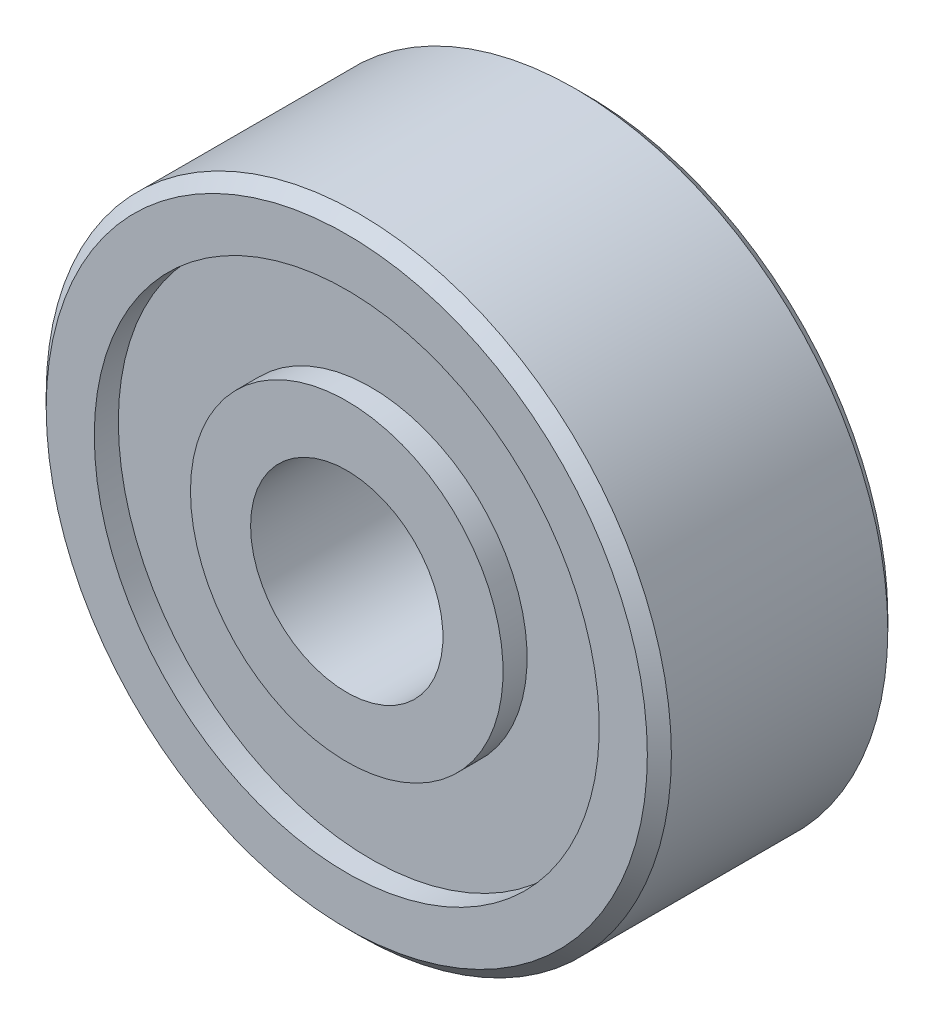
ISO-10303-21;
HEADER;
FILE_DESCRIPTION(('STEP AP214'),'2;1');
FILE_NAME('part.step','',(''),(''),'','','');
FILE_SCHEMA(('AUTOMOTIVE_DESIGN { 1 0 10303 214 1 1 1 1 }'));
ENDSEC;
DATA;
#1=APPLICATION_CONTEXT('core data for automotive mechanical design processes');
#2=APPLICATION_PROTOCOL_DEFINITION('international standard','automotive_design',2000,#1);
#3=PRODUCT_CONTEXT('',#1,'mechanical');
#4=PRODUCT('Part','Part','',(#3));
#5=PRODUCT_RELATED_PRODUCT_CATEGORY('part','',(#4));
#6=PRODUCT_DEFINITION_FORMATION('','',#4);
#7=PRODUCT_DEFINITION_CONTEXT('part definition',#1,'design');
#8=PRODUCT_DEFINITION('design','',#6,#7);
#9=PRODUCT_DEFINITION_SHAPE('','',#8);
#10=(LENGTH_UNIT() NAMED_UNIT(*) SI_UNIT(.MILLI.,.METRE.));
#11=(NAMED_UNIT(*) PLANE_ANGLE_UNIT() SI_UNIT($,.RADIAN.));
#12=(NAMED_UNIT(*) SI_UNIT($,.STERADIAN.) SOLID_ANGLE_UNIT());
#13=UNCERTAINTY_MEASURE_WITH_UNIT(LENGTH_MEASURE(1.E-05),#10,'distance_accuracy_value','');
#14=(GEOMETRIC_REPRESENTATION_CONTEXT(3) GLOBAL_UNCERTAINTY_ASSIGNED_CONTEXT((#13)) GLOBAL_UNIT_ASSIGNED_CONTEXT((#10,
#11,#12)) REPRESENTATION_CONTEXT('',''));
#15=CARTESIAN_POINT('',(0.,0.,0.));
#16=DIRECTION('',(0.,0.,1.));
#17=DIRECTION('',(1.,0.,0.));
#18=AXIS2_PLACEMENT_3D('',#15,#16,#17);
#19=CARTESIAN_POINT('',(0.,0.,2.5));
#20=DIRECTION('',(0.,0.,-1.));
#21=DIRECTION('',(-1.,0.,0.));
#22=AXIS2_PLACEMENT_3D('',#19,#20,#21);
#23=CYLINDRICAL_SURFACE('',#22,6.5);
#24=CARTESIAN_POINT('',(0.,0.,2.25));
#25=DIRECTION('',(0.,0.,-1.));
#26=DIRECTION('',(-1.,0.,0.));
#27=AXIS2_PLACEMENT_3D('',#24,#25,#26);
#28=CIRCLE('',#27,6.5);
#29=CARTESIAN_POINT('',(-6.5,0.,2.25));
#30=VERTEX_POINT('',#29);
#31=EDGE_CURVE('E10',#30,#30,#28,.T.);
#32=ORIENTED_EDGE('',*,*,#31,.T.);
#33=EDGE_LOOP('',(#32));
#34=FACE_BOUND('',#33,.T.);
#35=CARTESIAN_POINT('',(0.,0.,-2.25));
#36=DIRECTION('',(0.,0.,-1.));
#37=DIRECTION('',(-1.,0.,0.));
#38=AXIS2_PLACEMENT_3D('',#35,#36,#37);
#39=CIRCLE('',#38,6.5);
#40=CARTESIAN_POINT('',(-6.49999999999999,0.,-2.25));
#41=VERTEX_POINT('',#40);
#42=EDGE_CURVE('E74',#41,#41,#39,.T.);
#43=ORIENTED_EDGE('',*,*,#42,.F.);
#44=EDGE_LOOP('',(#43));
#45=FACE_BOUND('',#44,.T.);
#46=ADVANCED_FACE('F28',(#34,#45),#23,.T.);
#47=CARTESIAN_POINT('',(0.,0.,2.25));
#48=DIRECTION('',(0.,0.,-1.));
#49=DIRECTION('',(-1.,0.,0.));
#50=AXIS2_PLACEMENT_3D('',#47,#48,#49);
#51=CONICAL_SURFACE('',#50,6.5,0.785398163397456);
#52=CARTESIAN_POINT('',(0.,0.,2.5));
#53=DIRECTION('',(0.,0.,-1.));
#54=DIRECTION('',(-1.,0.,0.));
#55=AXIS2_PLACEMENT_3D('',#52,#53,#54);
#56=CIRCLE('',#55,6.25);
#57=CARTESIAN_POINT('',(-6.24999999999999,0.,2.5));
#58=VERTEX_POINT('',#57);
#59=EDGE_CURVE('E34',#58,#58,#56,.T.);
#60=ORIENTED_EDGE('',*,*,#59,.T.);
#61=EDGE_LOOP('',(#60));
#62=FACE_BOUND('',#61,.T.);
#63=ORIENTED_EDGE('',*,*,#31,.F.);
#64=EDGE_LOOP('',(#63));
#65=FACE_BOUND('',#64,.T.);
#66=ADVANCED_FACE('F82',(#62,#65),#51,.T.);
#67=CARTESIAN_POINT('',(6.25,0.,2.5));
#68=DIRECTION('',(0.,0.,1.));
#69=DIRECTION('',(1.,0.,0.));
#70=AXIS2_PLACEMENT_3D('',#67,#68,#69);
#71=PLANE('',#70);
#72=CARTESIAN_POINT('',(0.,0.,2.5));
#73=DIRECTION('',(0.,0.,-1.));
#74=DIRECTION('',(-1.,0.,0.));
#75=AXIS2_PLACEMENT_3D('',#72,#73,#74);
#76=CIRCLE('',#75,5.25);
#77=CARTESIAN_POINT('',(-5.24999999999999,0.,2.5));
#78=VERTEX_POINT('',#77);
#79=EDGE_CURVE('E38',#78,#78,#76,.T.);
#80=ORIENTED_EDGE('',*,*,#79,.T.);
#81=EDGE_LOOP('',(#80));
#82=FACE_BOUND('',#81,.T.);
#83=ORIENTED_EDGE('',*,*,#59,.F.);
#84=EDGE_LOOP('',(#83));
#85=FACE_BOUND('',#84,.T.);
#86=ADVANCED_FACE('F86',(#82,#85),#71,.T.);
#87=CARTESIAN_POINT('',(0.,0.,2.5));
#88=DIRECTION('',(0.,0.,-1.));
#89=DIRECTION('',(-1.,0.,0.));
#90=AXIS2_PLACEMENT_3D('',#87,#88,#89);
#91=CYLINDRICAL_SURFACE('',#90,5.25);
#92=CARTESIAN_POINT('',(0.,0.,2.));
#93=DIRECTION('',(0.,0.,-1.));
#94=DIRECTION('',(-1.,0.,0.));
#95=AXIS2_PLACEMENT_3D('',#92,#93,#94);
#96=CIRCLE('',#95,5.25);
#97=CARTESIAN_POINT('',(-5.24999999999999,0.,2.));
#98=VERTEX_POINT('',#97);
#99=EDGE_CURVE('E42',#98,#98,#96,.T.);
#100=ORIENTED_EDGE('',*,*,#99,.T.);
#101=EDGE_LOOP('',(#100));
#102=FACE_BOUND('',#101,.T.);
#103=ORIENTED_EDGE('',*,*,#79,.F.);
#104=EDGE_LOOP('',(#103));
#105=FACE_BOUND('',#104,.T.);
#106=ADVANCED_FACE('F90',(#102,#105),#91,.F.);
#107=CARTESIAN_POINT('',(5.25,0.,2.));
#108=DIRECTION('',(0.,0.,1.));
#109=DIRECTION('',(1.,0.,0.));
#110=AXIS2_PLACEMENT_3D('',#107,#108,#109);
#111=PLANE('',#110);
#112=CARTESIAN_POINT('',(0.,0.,2.));
#113=DIRECTION('',(0.,0.,-1.));
#114=DIRECTION('',(-1.,0.,0.));
#115=AXIS2_PLACEMENT_3D('',#112,#113,#114);
#116=CIRCLE('',#115,3.25);
#117=CARTESIAN_POINT('',(-3.24999999999999,0.,2.));
#118=VERTEX_POINT('',#117);
#119=EDGE_CURVE('E47',#118,#118,#116,.T.);
#120=ORIENTED_EDGE('',*,*,#119,.T.);
#121=EDGE_LOOP('',(#120));
#122=FACE_BOUND('',#121,.T.);
#123=ORIENTED_EDGE('',*,*,#99,.F.);
#124=EDGE_LOOP('',(#123));
#125=FACE_BOUND('',#124,.T.);
#126=ADVANCED_FACE('F97',(#122,#125),#111,.T.);
#127=CARTESIAN_POINT('',(0.,0.,2.5));
#128=DIRECTION('',(0.,0.,-1.));
#129=DIRECTION('',(-1.,0.,0.));
#130=AXIS2_PLACEMENT_3D('',#127,#128,#129);
#131=CYLINDRICAL_SURFACE('',#130,3.25);
#132=CARTESIAN_POINT('',(0.,0.,2.5));
#133=DIRECTION('',(0.,0.,-1.));
#134=DIRECTION('',(-1.,0.,0.));
#135=AXIS2_PLACEMENT_3D('',#132,#133,#134);
#136=CIRCLE('',#135,3.25);
#137=CARTESIAN_POINT('',(-3.24999999999999,0.,2.5));
#138=VERTEX_POINT('',#137);
#139=EDGE_CURVE('E50',#138,#138,#136,.T.);
#140=ORIENTED_EDGE('',*,*,#139,.T.);
#141=EDGE_LOOP('',(#140));
#142=FACE_BOUND('',#141,.T.);
#143=ORIENTED_EDGE('',*,*,#119,.F.);
#144=EDGE_LOOP('',(#143));
#145=FACE_BOUND('',#144,.T.);
#146=ADVANCED_FACE('F101',(#142,#145),#131,.T.);
#147=CARTESIAN_POINT('',(3.25,0.,2.5));
#148=DIRECTION('',(0.,0.,1.));
#149=DIRECTION('',(1.,0.,0.));
#150=AXIS2_PLACEMENT_3D('',#147,#148,#149);
#151=PLANE('',#150);
#152=CARTESIAN_POINT('',(0.,0.,2.5));
#153=DIRECTION('',(0.,0.,-1.));
#154=DIRECTION('',(-1.,0.,0.));
#155=AXIS2_PLACEMENT_3D('',#152,#153,#154);
#156=CIRCLE('',#155,2.);
#157=CARTESIAN_POINT('',(-2.,0.,2.5));
#158=VERTEX_POINT('',#157);
#159=EDGE_CURVE('E53',#158,#158,#156,.T.);
#160=ORIENTED_EDGE('',*,*,#159,.T.);
#161=EDGE_LOOP('',(#160));
#162=FACE_BOUND('',#161,.T.);
#163=ORIENTED_EDGE('',*,*,#139,.F.);
#164=EDGE_LOOP('',(#163));
#165=FACE_BOUND('',#164,.T.);
#166=ADVANCED_FACE('F105',(#162,#165),#151,.T.);
#167=CARTESIAN_POINT('',(0.,0.,2.5));
#168=DIRECTION('',(0.,0.,-1.));
#169=DIRECTION('',(-1.,0.,0.));
#170=AXIS2_PLACEMENT_3D('',#167,#168,#169);
#171=CYLINDRICAL_SURFACE('',#170,2.);
#172=CARTESIAN_POINT('',(0.,0.,-2.5));
#173=DIRECTION('',(0.,0.,-1.));
#174=DIRECTION('',(-1.,0.,0.));
#175=AXIS2_PLACEMENT_3D('',#172,#173,#174);
#176=CIRCLE('',#175,2.);
#177=CARTESIAN_POINT('',(-2.,0.,-2.5));
#178=VERTEX_POINT('',#177);
#179=EDGE_CURVE('E56',#178,#178,#176,.T.);
#180=ORIENTED_EDGE('',*,*,#179,.T.);
#181=EDGE_LOOP('',(#180));
#182=FACE_BOUND('',#181,.T.);
#183=ORIENTED_EDGE('',*,*,#159,.F.);
#184=EDGE_LOOP('',(#183));
#185=FACE_BOUND('',#184,.T.);
#186=ADVANCED_FACE('F109',(#182,#185),#171,.F.);
#187=CARTESIAN_POINT('',(2.,0.,-2.5));
#188=DIRECTION('',(0.,0.,-1.));
#189=DIRECTION('',(-1.,0.,0.));
#190=AXIS2_PLACEMENT_3D('',#187,#188,#189);
#191=PLANE('',#190);
#192=CARTESIAN_POINT('',(0.,0.,-2.5));
#193=DIRECTION('',(0.,0.,-1.));
#194=DIRECTION('',(-1.,0.,0.));
#195=AXIS2_PLACEMENT_3D('',#192,#193,#194);
#196=CIRCLE('',#195,3.25);
#197=CARTESIAN_POINT('',(-3.24999999999999,0.,-2.5));
#198=VERTEX_POINT('',#197);
#199=EDGE_CURVE('E59',#198,#198,#196,.T.);
#200=ORIENTED_EDGE('',*,*,#199,.T.);
#201=EDGE_LOOP('',(#200));
#202=FACE_BOUND('',#201,.T.);
#203=ORIENTED_EDGE('',*,*,#179,.F.);
#204=EDGE_LOOP('',(#203));
#205=FACE_BOUND('',#204,.T.);
#206=ADVANCED_FACE('F113',(#202,#205),#191,.T.);
#207=CARTESIAN_POINT('',(0.,0.,2.5));
#208=DIRECTION('',(0.,0.,-1.));
#209=DIRECTION('',(-1.,0.,0.));
#210=AXIS2_PLACEMENT_3D('',#207,#208,#209);
#211=CYLINDRICAL_SURFACE('',#210,3.25);
#212=CARTESIAN_POINT('',(0.,0.,-2.));
#213=DIRECTION('',(0.,0.,-1.));
#214=DIRECTION('',(-1.,0.,0.));
#215=AXIS2_PLACEMENT_3D('',#212,#213,#214);
#216=CIRCLE('',#215,3.25);
#217=CARTESIAN_POINT('',(-3.24999999999999,0.,-2.));
#218=VERTEX_POINT('',#217);
#219=EDGE_CURVE('E62',#218,#218,#216,.T.);
#220=ORIENTED_EDGE('',*,*,#219,.T.);
#221=EDGE_LOOP('',(#220));
#222=FACE_BOUND('',#221,.T.);
#223=ORIENTED_EDGE('',*,*,#199,.F.);
#224=EDGE_LOOP('',(#223));
#225=FACE_BOUND('',#224,.T.);
#226=ADVANCED_FACE('F117',(#222,#225),#211,.T.);
#227=CARTESIAN_POINT('',(3.25,0.,-2.));
#228=DIRECTION('',(0.,0.,-1.));
#229=DIRECTION('',(-1.,0.,0.));
#230=AXIS2_PLACEMENT_3D('',#227,#228,#229);
#231=PLANE('',#230);
#232=CARTESIAN_POINT('',(0.,0.,-2.));
#233=DIRECTION('',(0.,0.,-1.));
#234=DIRECTION('',(-1.,0.,0.));
#235=AXIS2_PLACEMENT_3D('',#232,#233,#234);
#236=CIRCLE('',#235,5.25);
#237=CARTESIAN_POINT('',(-5.24999999999999,0.,-2.));
#238=VERTEX_POINT('',#237);
#239=EDGE_CURVE('E65',#238,#238,#236,.T.);
#240=ORIENTED_EDGE('',*,*,#239,.T.);
#241=EDGE_LOOP('',(#240));
#242=FACE_BOUND('',#241,.T.);
#243=ORIENTED_EDGE('',*,*,#219,.F.);
#244=EDGE_LOOP('',(#243));
#245=FACE_BOUND('',#244,.T.);
#246=ADVANCED_FACE('F121',(#242,#245),#231,.T.);
#247=CARTESIAN_POINT('',(0.,0.,2.5));
#248=DIRECTION('',(0.,0.,-1.));
#249=DIRECTION('',(-1.,0.,0.));
#250=AXIS2_PLACEMENT_3D('',#247,#248,#249);
#251=CYLINDRICAL_SURFACE('',#250,5.25);
#252=CARTESIAN_POINT('',(0.,0.,-2.5));
#253=DIRECTION('',(0.,0.,-1.));
#254=DIRECTION('',(-1.,0.,0.));
#255=AXIS2_PLACEMENT_3D('',#252,#253,#254);
#256=CIRCLE('',#255,5.25);
#257=CARTESIAN_POINT('',(-5.24999999999999,0.,-2.5));
#258=VERTEX_POINT('',#257);
#259=EDGE_CURVE('E68',#258,#258,#256,.T.);
#260=ORIENTED_EDGE('',*,*,#259,.T.);
#261=EDGE_LOOP('',(#260));
#262=FACE_BOUND('',#261,.T.);
#263=ORIENTED_EDGE('',*,*,#239,.F.);
#264=EDGE_LOOP('',(#263));
#265=FACE_BOUND('',#264,.T.);
#266=ADVANCED_FACE('F125',(#262,#265),#251,.F.);
#267=CARTESIAN_POINT('',(5.25,0.,-2.5));
#268=DIRECTION('',(0.,0.,-1.));
#269=DIRECTION('',(-1.,0.,0.));
#270=AXIS2_PLACEMENT_3D('',#267,#268,#269);
#271=PLANE('',#270);
#272=CARTESIAN_POINT('',(0.,0.,-2.5));
#273=DIRECTION('',(0.,0.,-1.));
#274=DIRECTION('',(-1.,0.,0.));
#275=AXIS2_PLACEMENT_3D('',#272,#273,#274);
#276=CIRCLE('',#275,6.25);
#277=CARTESIAN_POINT('',(-6.24999999999999,0.,-2.5));
#278=VERTEX_POINT('',#277);
#279=EDGE_CURVE('E71',#278,#278,#276,.T.);
#280=ORIENTED_EDGE('',*,*,#279,.T.);
#281=EDGE_LOOP('',(#280));
#282=FACE_BOUND('',#281,.T.);
#283=ORIENTED_EDGE('',*,*,#259,.F.);
#284=EDGE_LOOP('',(#283));
#285=FACE_BOUND('',#284,.T.);
#286=ADVANCED_FACE('F129',(#282,#285),#271,.T.);
#287=CARTESIAN_POINT('',(0.,0.,-2.5));
#288=DIRECTION('',(0.,0.,1.));
#289=DIRECTION('',(1.,0.,0.));
#290=AXIS2_PLACEMENT_3D('',#287,#288,#289);
#291=CONICAL_SURFACE('',#290,6.25,0.785398163397452);
#292=ORIENTED_EDGE('',*,*,#42,.T.);
#293=EDGE_LOOP('',(#292));
#294=FACE_BOUND('',#293,.T.);
#295=ORIENTED_EDGE('',*,*,#279,.F.);
#296=EDGE_LOOP('',(#295));
#297=FACE_BOUND('',#296,.T.);
#298=ADVANCED_FACE('F78',(#294,#297),#291,.T.);
#299=CLOSED_SHELL('',(#46,#66,#86,#106,#126,#146,#166,#186,#206,#226,#246,#266,#286,#298));
#300=MANIFOLD_SOLID_BREP('B2',#299);
#301=ADVANCED_BREP_SHAPE_REPRESENTATION('',(#18,#300),#14);
#302=SHAPE_DEFINITION_REPRESENTATION(#9,#301);
ENDSEC;
END-ISO-10303-21;
